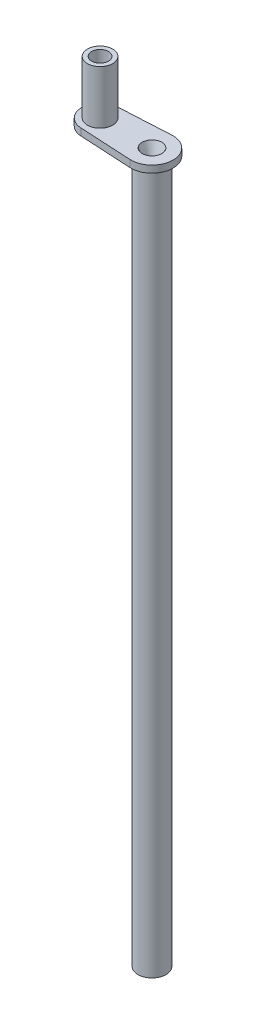
ISO-10303-21;
HEADER;
FILE_DESCRIPTION(('STEP AP214'),'2;1');
FILE_NAME('part.step','',(''),(''),'','','');
FILE_SCHEMA(('AUTOMOTIVE_DESIGN { 1 0 10303 214 1 1 1 1 }'));
ENDSEC;
DATA;
#1=APPLICATION_CONTEXT('core data for automotive mechanical design processes');
#2=APPLICATION_PROTOCOL_DEFINITION('international standard','automotive_design',2000,#1);
#3=PRODUCT_CONTEXT('',#1,'mechanical');
#4=PRODUCT('Part','Part','',(#3));
#5=PRODUCT_RELATED_PRODUCT_CATEGORY('part','',(#4));
#6=PRODUCT_DEFINITION_FORMATION('','',#4);
#7=PRODUCT_DEFINITION_CONTEXT('part definition',#1,'design');
#8=PRODUCT_DEFINITION('design','',#6,#7);
#9=PRODUCT_DEFINITION_SHAPE('','',#8);
#10=(LENGTH_UNIT() NAMED_UNIT(*) SI_UNIT(.MILLI.,.METRE.));
#11=(NAMED_UNIT(*) PLANE_ANGLE_UNIT() SI_UNIT($,.RADIAN.));
#12=(NAMED_UNIT(*) SI_UNIT($,.STERADIAN.) SOLID_ANGLE_UNIT());
#13=UNCERTAINTY_MEASURE_WITH_UNIT(LENGTH_MEASURE(1.E-05),#10,'distance_accuracy_value','');
#14=(GEOMETRIC_REPRESENTATION_CONTEXT(3) GLOBAL_UNCERTAINTY_ASSIGNED_CONTEXT((#13)) GLOBAL_UNIT_ASSIGNED_CONTEXT((#10,
#11,#12)) REPRESENTATION_CONTEXT('',''));
#15=CARTESIAN_POINT('',(0.,0.,0.));
#16=DIRECTION('',(0.,0.,1.));
#17=DIRECTION('',(1.,0.,0.));
#18=AXIS2_PLACEMENT_3D('',#15,#16,#17);
#19=CARTESIAN_POINT('',(-11.9752615473774,250.,-2.21460316287116));
#20=DIRECTION('',(0.,-1.,0.));
#21=DIRECTION('',(0.,0.,-1.));
#22=AXIS2_PLACEMENT_3D('',#19,#20,#21);
#23=CYLINDRICAL_SURFACE('',#22,5.);
#24=CARTESIAN_POINT('',(-11.9752615473774,250.,-2.21460316287116));
#25=DIRECTION('',(0.,1.,0.));
#26=DIRECTION('',(0.,0.,1.));
#27=AXIS2_PLACEMENT_3D('',#24,#25,#26);
#28=CIRCLE('',#27,5.);
#29=CARTESIAN_POINT('',(-11.9752615473774,250.,2.78539683712884));
#30=VERTEX_POINT('',#29);
#31=EDGE_CURVE('E12',#30,#30,#28,.T.);
#32=ORIENTED_EDGE('',*,*,#31,.F.);
#33=EDGE_LOOP('',(#32));
#34=FACE_BOUND('',#33,.T.);
#35=CARTESIAN_POINT('',(-11.9752615473774,0.,-2.21460316287116));
#36=DIRECTION('',(0.,1.,0.));
#37=DIRECTION('',(0.,0.,1.));
#38=AXIS2_PLACEMENT_3D('',#35,#36,#37);
#39=CIRCLE('',#38,5.);
#40=CARTESIAN_POINT('',(-11.9752615473774,0.,2.78539683712884));
#41=VERTEX_POINT('',#40);
#42=EDGE_CURVE('E47',#41,#41,#39,.T.);
#43=ORIENTED_EDGE('',*,*,#42,.T.);
#44=EDGE_LOOP('',(#43));
#45=FACE_BOUND('',#44,.T.);
#46=ADVANCED_FACE('F37',(#34,#45),#23,.T.);
#47=CARTESIAN_POINT('',(-11.9752615473774,0.,-2.21460316287116));
#48=DIRECTION('',(0.,1.,0.));
#49=DIRECTION('',(0.,0.,1.));
#50=AXIS2_PLACEMENT_3D('',#47,#48,#49);
#51=PLANE('',#50);
#52=CARTESIAN_POINT('',(-11.9752615473774,0.,-2.21460316287116));
#53=DIRECTION('',(0.,-1.,0.));
#54=DIRECTION('',(0.,0.,-1.));
#55=AXIS2_PLACEMENT_3D('',#52,#53,#54);
#56=CIRCLE('',#55,4.);
#57=CARTESIAN_POINT('',(-14.3869797141335,0.,0.976574595283127));
#58=VERTEX_POINT('',#57);
#59=EDGE_CURVE('E170',#58,#58,#56,.T.);
#60=ORIENTED_EDGE('',*,*,#59,.F.);
#61=EDGE_LOOP('',(#60));
#62=FACE_BOUND('',#61,.T.);
#63=ORIENTED_EDGE('',*,*,#42,.F.);
#64=EDGE_LOOP('',(#63));
#65=FACE_BOUND('',#64,.T.);
#66=ADVANCED_FACE('F143',(#62,#65),#51,.F.);
#67=CARTESIAN_POINT('',(-11.9752615473774,7.,-2.21460316287116));
#68=DIRECTION('',(0.,-1.,0.));
#69=DIRECTION('',(0.,0.,-1.));
#70=AXIS2_PLACEMENT_3D('',#67,#68,#69);
#71=PLANE('',#70);
#72=CARTESIAN_POINT('',(-11.9752615473774,7.,-2.21460316287116));
#73=DIRECTION('',(0.,-1.,0.));
#74=DIRECTION('',(0.,0.,-1.));
#75=AXIS2_PLACEMENT_3D('',#72,#73,#74);
#76=CIRCLE('',#75,1.);
#77=CARTESIAN_POINT('',(-12.7560846521862,7.,-1.589850988808));
#78=VERTEX_POINT('',#77);
#79=EDGE_CURVE('E117',#78,#78,#76,.T.);
#80=ORIENTED_EDGE('',*,*,#79,.T.);
#81=EDGE_LOOP('',(#80));
#82=FACE_BOUND('',#81,.T.);
#83=ADVANCED_FACE('F140',(#82),#71,.T.);
#84=CARTESIAN_POINT('',(-12.7560846521862,7.,-1.589850988808));
#85=CARTESIAN_POINT('',(-14.3869797141335,0.,0.976574595283127));
#86=CARTESIAN_POINT('',(-14.0055890003126,7.,-3.15149719842574));
#87=CARTESIAN_POINT('',(-20.769335230442,0.,-3.84686173822906));
#88=CARTESIAN_POINT('',(-12.4439427906948,7.,-4.40100154655205));
#89=CARTESIAN_POINT('',(-15.9458988969298,0.,-10.2292172545376));
#90=CARTESIAN_POINT('',(-11.1944384425685,7.,-2.83935533693431));
#91=CARTESIAN_POINT('',(-9.56354338062128,0.,-5.40578092102544));
#92=CARTESIAN_POINT('',(-9.9449340944422,7.,-1.27770912731657));
#93=CARTESIAN_POINT('',(-3.18118786431272,0.,-0.582344587513256));
#94=CARTESIAN_POINT('',(-11.5065803040599,7.,-0.028204779190265));
#95=CARTESIAN_POINT('',(-8.0046241978249,0.,5.80001092879531));
#96=CARTESIAN_POINT('',(-12.7560846521862,7.,-1.589850988808));
#97=CARTESIAN_POINT('',(-14.3869797141335,0.,0.976574595283127));
#98=(BOUNDED_SURFACE() B_SPLINE_SURFACE(3,1,((#84,#85),(#86,#87),(#88,#89),(#90,#91),(#92,#93),
(#94,#95),(#96,#97)),.UNSPECIFIED.,.T.,.F.,.F.) B_SPLINE_SURFACE_WITH_KNOTS((4,3,4),(2,2),(0.,
0.5,1.),(0.,1.),.UNSPECIFIED.) GEOMETRIC_REPRESENTATION_ITEM() RATIONAL_B_SPLINE_SURFACE(((1.,
1.),(0.333333333333333,0.333333333333334),(0.333333333333333,0.333333333333334),(1.,1.),
(0.333333333333333,0.333333333333333),(0.333333333333333,0.333333333333333),(1.,1.))) REPRESENTATION_ITEM('') SURFACE());
#99=CARTESIAN_POINT('',(-12.7560846521862,7.,-1.589850988808));
#100=CARTESIAN_POINT('',(-12.7730731424149,6.92708333333333,-1.56311738897372));
#101=CARTESIAN_POINT('',(-12.7900616326435,6.85416666666667,-1.53638378913944));
#102=CARTESIAN_POINT('',(-12.8240386131007,6.70833333333333,-1.48291658947087));
#103=CARTESIAN_POINT('',(-12.8410271033293,6.63541666666667,-1.45618298963659));
#104=CARTESIAN_POINT('',(-12.8750040837866,6.48958333333333,-1.40271578996803));
#105=CARTESIAN_POINT('',(-12.8919925740152,6.41666666666667,-1.37598219013374));
#106=CARTESIAN_POINT('',(-12.9259695544724,6.27083333333333,-1.32251499046518));
#107=CARTESIAN_POINT('',(-12.942958044701,6.19791666666667,-1.2957813906309));
#108=CARTESIAN_POINT('',(-12.9769350251583,6.05208333333333,-1.24231419096233));
#109=CARTESIAN_POINT('',(-12.9939235153869,5.97916666666667,-1.21558059112805));
#110=CARTESIAN_POINT('',(-13.0279004958441,5.83333333333333,-1.16211339145948));
#111=CARTESIAN_POINT('',(-13.0448889860727,5.76041666666667,-1.1353797916252));
#112=CARTESIAN_POINT('',(-13.07886596653,5.61458333333333,-1.08191259195663));
#113=CARTESIAN_POINT('',(-13.0958544567586,5.54166666666667,-1.05517899212235));
#114=CARTESIAN_POINT('',(-13.1298314372158,5.39583333333333,-1.00171179245379));
#115=CARTESIAN_POINT('',(-13.1468199274444,5.32291666666667,-0.974978192619504));
#116=CARTESIAN_POINT('',(-13.1807969079017,5.17708333333333,-0.921510992950939));
#117=CARTESIAN_POINT('',(-13.1977853981303,5.10416666666667,-0.894777393116656));
#118=CARTESIAN_POINT('',(-13.2317623785875,4.95833333333333,-0.841310193448091));
#119=CARTESIAN_POINT('',(-13.2487508688161,4.88541666666667,-0.814576593613809));
#120=CARTESIAN_POINT('',(-13.2827278492734,4.73958333333333,-0.761109393945243));
#121=CARTESIAN_POINT('',(-13.299716339502,4.66666666666667,-0.734375794110961));
#122=CARTESIAN_POINT('',(-13.3336933199592,4.52083333333333,-0.680908594442395));
#123=CARTESIAN_POINT('',(-13.3506818101878,4.44791666666667,-0.654174994608113));
#124=CARTESIAN_POINT('',(-13.3846587906451,4.30208333333333,-0.600707794939548));
#125=CARTESIAN_POINT('',(-13.4016472808737,4.22916666666667,-0.573974195105265));
#126=CARTESIAN_POINT('',(-13.4356242613309,4.08333333333333,-0.5205069954367));
#127=CARTESIAN_POINT('',(-13.4526127515595,4.01041666666667,-0.493773395602417));
#128=CARTESIAN_POINT('',(-13.4865897320168,3.86458333333333,-0.440306195933852));
#129=CARTESIAN_POINT('',(-13.5035782222454,3.79166666666667,-0.413572596099569));
#130=CARTESIAN_POINT('',(-13.5375552027026,3.64583333333333,-0.360105396431004));
#131=CARTESIAN_POINT('',(-13.5545436929312,3.57291666666667,-0.333371796596721));
#132=CARTESIAN_POINT('',(-13.5885206733885,3.42708333333333,-0.279904596928156));
#133=CARTESIAN_POINT('',(-13.6055091636171,3.35416666666667,-0.253170997093874));
#134=CARTESIAN_POINT('',(-13.6394861440743,3.20833333333333,-0.199703797425308));
#135=CARTESIAN_POINT('',(-13.6564746343029,3.13541666666667,-0.172970197591026));
#136=CARTESIAN_POINT('',(-13.6904516147602,2.98958333333333,-0.11950299792246));
#137=CARTESIAN_POINT('',(-13.7074401049888,2.91666666666667,-0.0927693980881779));
#138=CARTESIAN_POINT('',(-13.741417085446,2.77083333333333,-0.0393021984196126));
#139=CARTESIAN_POINT('',(-13.7584055756746,2.69791666666667,-0.0125685985853299));
#140=CARTESIAN_POINT('',(-13.7923825561319,2.55208333333333,0.0408986010832353));
#141=CARTESIAN_POINT('',(-13.8093710463605,2.47916666666667,0.0676322009175178));
#142=CARTESIAN_POINT('',(-13.8433480268177,2.33333333333333,0.121099400586083));
#143=CARTESIAN_POINT('',(-13.8603365170463,2.26041666666667,0.147833000420366));
#144=CARTESIAN_POINT('',(-13.8943134975036,2.11458333333333,0.201300200088931));
#145=CARTESIAN_POINT('',(-13.9113019877322,2.04166666666667,0.228033799923214));
#146=CARTESIAN_POINT('',(-13.9452789681894,1.89583333333333,0.281500999591779));
#147=CARTESIAN_POINT('',(-13.9622674584181,1.82291666666667,0.308234599426061));
#148=CARTESIAN_POINT('',(-13.9962444388753,1.67708333333333,0.361701799094627));
#149=CARTESIAN_POINT('',(-14.0132329291039,1.60416666666667,0.388435398928909));
#150=CARTESIAN_POINT('',(-14.0472099095611,1.45833333333333,0.441902598597474));
#151=CARTESIAN_POINT('',(-14.0641983997898,1.38541666666667,0.468636198431757));
#152=CARTESIAN_POINT('',(-14.098175380247,1.23958333333333,0.522103398100322));
#153=CARTESIAN_POINT('',(-14.1151638704756,1.16666666666667,0.548836997934605));
#154=CARTESIAN_POINT('',(-14.1491408509328,1.02083333333333,0.60230419760317));
#155=CARTESIAN_POINT('',(-14.1661293411615,0.947916666666667,0.629037797437453));
#156=CARTESIAN_POINT('',(-14.2001063216187,0.802083333333333,0.682504997106018));
#157=CARTESIAN_POINT('',(-14.2170948118473,0.729166666666667,0.709238596940301));
#158=CARTESIAN_POINT('',(-14.2510717923045,0.583333333333333,0.762705796608866));
#159=CARTESIAN_POINT('',(-14.2680602825332,0.510416666666667,0.789439396443148));
#160=CARTESIAN_POINT('',(-14.3020372629904,0.364583333333333,0.842906596111714));
#161=CARTESIAN_POINT('',(-14.319025753219,0.291666666666667,0.869640195945996));
#162=CARTESIAN_POINT('',(-14.3530027336762,0.145833333333333,0.923107395614561));
#163=CARTESIAN_POINT('',(-14.3699912239049,0.0729166666666665,0.949840995448844));
#164=CARTESIAN_POINT('',(-14.3869797141335,0.,0.976574595283127));
#165=B_SPLINE_CURVE_WITH_KNOTS('',3,(#99,#100,#101,#102,#103,#104,#105,#106,#107,#108,#109,#110,
#111,#112,#113,#114,#115,#116,#117,#118,#119,#120,#121,#122,#123,#124,#125,#126,#127,#128,#129,
#130,#131,#132,#133,#134,#135,#136,#137,#138,#139,#140,#141,#142,#143,#144,#145,#146,#147,#148,
#149,#150,#151,#152,#153,#154,#155,#156,#157,#158,#159,#160,#161,#162,#163,#164),.UNSPECIFIED.,
.F.,.F.,(4,2,2,2,2,2,2,2,2,2,2,2,2,2,2,2,2,2,2,2,2,2,2,2,2,2,2,2,2,2,2,2,4),(0.,0.2384978195773,
0.4769956391546,0.7154934587319,0.953991278309199,1.1924890978865,1.4309869174638,
1.6694847370411,1.9079825566184,2.1464803761957,2.384978195773,2.6234760153503,2.8619738349276,
3.1004716545049,3.3389694740822,3.5774672936595,3.8159651132368,4.0544629328141,4.2929607523914,
4.5314585719687,4.769956391546,5.0084542111233,5.2469520307006,5.4854498502779,5.7239476698552,
5.9624454894325,6.2009433090098,6.4394411285871,6.6779389481644,6.9164367677417,7.154934587319,
7.3934324068963,7.6319302264736),.UNSPECIFIED.);
#166=EDGE_CURVE('BSEAM128',#78,#58,#165,.T.);
#167=ORIENTED_EDGE('',*,*,#79,.F.);
#168=ORIENTED_EDGE('',*,*,#59,.T.);
#169=ORIENTED_EDGE('',*,*,#166,.T.);
#170=ORIENTED_EDGE('',*,*,#166,.F.);
#171=EDGE_LOOP('',(#167,#169,#168,#170));
#172=FACE_BOUND('',#171,.T.);
#173=ADVANCED_FACE('F128',(#172),#98,.F.);
#174=CARTESIAN_POINT('',(-30.4752615473774,252.5,-2.21460316287116));
#175=DIRECTION('',(0.,-1.,0.));
#176=DIRECTION('',(0.,0.,-1.));
#177=AXIS2_PLACEMENT_3D('',#174,#175,#176);
#178=CYLINDRICAL_SURFACE('',#177,6.5);
#179=CARTESIAN_POINT('',(-30.4752615473774,250.,-2.21460316287116));
#180=DIRECTION('',(0.,1.,0.));
#181=DIRECTION('',(0.,0.,1.));
#182=AXIS2_PLACEMENT_3D('',#179,#180,#181);
#183=CIRCLE('',#182,6.5);
#184=CARTESIAN_POINT('',(-30.8266128987287,250.,-8.70510023381292));
#185=VERTEX_POINT('',#184);
#186=CARTESIAN_POINT('',(-30.8266128987287,250.,4.27589390807061));
#187=VERTEX_POINT('',#186);
#188=EDGE_CURVE('E107',#185,#187,#183,.T.);
#189=ORIENTED_EDGE('',*,*,#188,.T.);
#190=DIRECTION('',(0.,-1.,0.));
#191=VECTOR('',#190,1.);
#192=CARTESIAN_POINT('',(-30.8266128987287,252.5,4.27589390807061));
#193=LINE('',#192,#191);
#194=CARTESIAN_POINT('',(-30.8266128987287,252.5,4.27589390807061));
#195=VERTEX_POINT('',#194);
#196=EDGE_CURVE('E98',#195,#187,#193,.T.);
#197=ORIENTED_EDGE('',*,*,#196,.F.);
#198=CARTESIAN_POINT('',(-30.4752615473774,252.5,-2.21460316287116));
#199=DIRECTION('',(0.,1.,0.));
#200=DIRECTION('',(0.,0.,1.));
#201=AXIS2_PLACEMENT_3D('',#198,#199,#200);
#202=CIRCLE('',#201,6.5);
#203=CARTESIAN_POINT('',(-30.8266128987287,252.5,-8.70510023381292));
#204=VERTEX_POINT('',#203);
#205=EDGE_CURVE('E92',#204,#195,#202,.T.);
#206=ORIENTED_EDGE('',*,*,#205,.F.);
#207=DIRECTION('',(0.,-1.,0.));
#208=VECTOR('',#207,1.);
#209=CARTESIAN_POINT('',(-30.8266128987287,252.5,-8.70510023381292));
#210=LINE('',#209,#208);
#211=EDGE_CURVE('E103',#204,#185,#210,.T.);
#212=ORIENTED_EDGE('',*,*,#211,.T.);
#213=EDGE_LOOP('',(#189,#197,#206,#212));
#214=FACE_BOUND('',#213,.T.);
#215=ADVANCED_FACE('F139',(#214),#178,.T.);
#216=CARTESIAN_POINT('',(-30.8266128987287,252.5,4.27589390807061));
#217=DIRECTION('',(0.054054054054054,0.,-0.998538010914117));
#218=DIRECTION('',(-0.998538010914117,0.,-0.054054054054054));
#219=AXIS2_PLACEMENT_3D('',#216,#217,#218);
#220=PLANE('',#219);
#221=DIRECTION('',(0.998538010914117,0.,0.054054054054054));
#222=VECTOR('',#221,1.);
#223=CARTESIAN_POINT('',(-30.8266128987287,250.,4.27589390807061));
#224=LINE('',#223,#222);
#225=CARTESIAN_POINT('',(-12.3806669527828,250.,5.27443191898472));
#226=VERTEX_POINT('',#225);
#227=EDGE_CURVE('E97',#187,#226,#224,.T.);
#228=ORIENTED_EDGE('',*,*,#227,.T.);
#229=DIRECTION('',(0.,-1.,0.));
#230=VECTOR('',#229,1.);
#231=CARTESIAN_POINT('',(-12.3806669527828,252.5,5.27443191898472));
#232=LINE('',#231,#230);
#233=CARTESIAN_POINT('',(-12.3806669527828,252.5,5.27443191898472));
#234=VERTEX_POINT('',#233);
#235=EDGE_CURVE('E95',#234,#226,#232,.T.);
#236=ORIENTED_EDGE('',*,*,#235,.F.);
#237=DIRECTION('',(0.998538010914117,0.,0.054054054054054));
#238=VECTOR('',#237,1.);
#239=CARTESIAN_POINT('',(-30.8266128987287,252.5,4.27589390807061));
#240=LINE('',#239,#238);
#241=EDGE_CURVE('E87',#195,#234,#240,.T.);
#242=ORIENTED_EDGE('',*,*,#241,.F.);
#243=ORIENTED_EDGE('',*,*,#196,.T.);
#244=EDGE_LOOP('',(#228,#236,#242,#243));
#245=FACE_BOUND('',#244,.T.);
#246=ADVANCED_FACE('F96',(#245),#220,.F.);
#247=CARTESIAN_POINT('',(-11.9752615473774,252.5,-2.21460316287116));
#248=DIRECTION('',(0.,-1.,0.));
#249=DIRECTION('',(0.,0.,-1.));
#250=AXIS2_PLACEMENT_3D('',#247,#248,#249);
#251=CYLINDRICAL_SURFACE('',#250,7.5);
#252=CARTESIAN_POINT('',(-11.9752615473774,250.,-2.21460316287116));
#253=DIRECTION('',(0.,1.,0.));
#254=DIRECTION('',(0.,0.,1.));
#255=AXIS2_PLACEMENT_3D('',#252,#253,#254);
#256=CIRCLE('',#255,7.5);
#257=CARTESIAN_POINT('',(-12.3806669527828,250.,-9.70363824472704));
#258=VERTEX_POINT('',#257);
#259=EDGE_CURVE('E73',#226,#258,#256,.T.);
#260=ORIENTED_EDGE('',*,*,#259,.T.);
#261=DIRECTION('',(0.,-1.,0.));
#262=VECTOR('',#261,1.);
#263=CARTESIAN_POINT('',(-12.3806669527828,252.5,-9.70363824472704));
#264=LINE('',#263,#262);
#265=CARTESIAN_POINT('',(-12.3806669527828,252.5,-9.70363824472704));
#266=VERTEX_POINT('',#265);
#267=EDGE_CURVE('E99',#266,#258,#264,.T.);
#268=ORIENTED_EDGE('',*,*,#267,.F.);
#269=CARTESIAN_POINT('',(-11.9752615473774,252.5,-2.21460316287116));
#270=DIRECTION('',(0.,1.,0.));
#271=DIRECTION('',(0.,0.,1.));
#272=AXIS2_PLACEMENT_3D('',#269,#270,#271);
#273=CIRCLE('',#272,7.5);
#274=EDGE_CURVE('E90',#234,#266,#273,.T.);
#275=ORIENTED_EDGE('',*,*,#274,.F.);
#276=ORIENTED_EDGE('',*,*,#235,.T.);
#277=EDGE_LOOP('',(#260,#268,#275,#276));
#278=FACE_BOUND('',#277,.T.);
#279=ADVANCED_FACE('F101',(#278),#251,.T.);
#280=CARTESIAN_POINT('',(-30.8266128987287,252.5,-8.70510023381292));
#281=DIRECTION('',(0.0540540540540542,0.,0.998538010914117));
#282=DIRECTION('',(0.998538010914117,0.,-0.0540540540540542));
#283=AXIS2_PLACEMENT_3D('',#280,#281,#282);
#284=PLANE('',#283);
#285=DIRECTION('',(-0.998538010914117,0.,0.0540540540540542));
#286=VECTOR('',#285,1.);
#287=CARTESIAN_POINT('',(-30.8266128987287,250.,-8.70510023381292));
#288=LINE('',#287,#286);
#289=EDGE_CURVE('E79',#258,#185,#288,.T.);
#290=ORIENTED_EDGE('',*,*,#289,.T.);
#291=ORIENTED_EDGE('',*,*,#211,.F.);
#292=DIRECTION('',(-0.998538010914117,0.,0.0540540540540542));
#293=VECTOR('',#292,1.);
#294=CARTESIAN_POINT('',(-30.8266128987287,252.5,-8.70510023381292));
#295=LINE('',#294,#293);
#296=EDGE_CURVE('E56',#266,#204,#295,.T.);
#297=ORIENTED_EDGE('',*,*,#296,.F.);
#298=ORIENTED_EDGE('',*,*,#267,.T.);
#299=EDGE_LOOP('',(#290,#291,#297,#298));
#300=FACE_BOUND('',#299,.T.);
#301=ADVANCED_FACE('F198',(#300),#284,.F.);
#302=CARTESIAN_POINT('',(-30.4752615473774,252.5,-2.21460316287116));
#303=DIRECTION('',(0.,1.,0.));
#304=DIRECTION('',(0.,0.,1.));
#305=AXIS2_PLACEMENT_3D('',#302,#303,#304);
#306=PLANE('',#305);
#307=CARTESIAN_POINT('',(-30.4752615473774,252.5,-2.21460316287116));
#308=DIRECTION('',(0.,1.,0.));
#309=DIRECTION('',(0.,0.,1.));
#310=AXIS2_PLACEMENT_3D('',#307,#308,#309);
#311=CIRCLE('',#310,4.5);
#312=CARTESIAN_POINT('',(-30.4752615473774,252.5,2.28539683712885));
#313=VERTEX_POINT('',#312);
#314=EDGE_CURVE('E322',#313,#313,#311,.T.);
#315=ORIENTED_EDGE('',*,*,#314,.F.);
#316=EDGE_LOOP('',(#315));
#317=FACE_BOUND('',#316,.T.);
#318=CARTESIAN_POINT('',(-11.9752615473774,252.5,-2.21460316287116));
#319=DIRECTION('',(0.,1.,0.));
#320=DIRECTION('',(0.,0.,1.));
#321=AXIS2_PLACEMENT_3D('',#318,#319,#320);
#322=CIRCLE('',#321,3.5);
#323=CARTESIAN_POINT('',(-14.6295282508879,252.5,0.0668148756819186));
#324=VERTEX_POINT('',#323);
#325=EDGE_CURVE('E110',#324,#324,#322,.T.);
#326=ORIENTED_EDGE('',*,*,#325,.F.);
#327=EDGE_LOOP('',(#326));
#328=FACE_BOUND('',#327,.T.);
#329=ORIENTED_EDGE('',*,*,#205,.T.);
#330=ORIENTED_EDGE('',*,*,#241,.T.);
#331=ORIENTED_EDGE('',*,*,#274,.T.);
#332=ORIENTED_EDGE('',*,*,#296,.T.);
#333=EDGE_LOOP('',(#329,#330,#331,#332));
#334=FACE_BOUND('',#333,.T.);
#335=ADVANCED_FACE('F88',(#317,#328,#334),#306,.T.);
#336=CARTESIAN_POINT('',(-30.4752615473774,250.,-2.21460316287116));
#337=DIRECTION('',(0.,1.,0.));
#338=DIRECTION('',(0.,0.,1.));
#339=AXIS2_PLACEMENT_3D('',#336,#337,#338);
#340=PLANE('',#339);
#341=CARTESIAN_POINT('',(-30.4752615473774,250.,-2.21460316287116));
#342=DIRECTION('',(0.,1.,0.));
#343=DIRECTION('',(0.,0.,1.));
#344=AXIS2_PLACEMENT_3D('',#341,#342,#343);
#345=CIRCLE('',#344,3.);
#346=CARTESIAN_POINT('',(-30.4752615473774,250.,0.785396837128846));
#347=VERTEX_POINT('',#346);
#348=EDGE_CURVE('E327',#347,#347,#345,.F.);
#349=ORIENTED_EDGE('',*,*,#348,.F.);
#350=EDGE_LOOP('',(#349));
#351=FACE_BOUND('',#350,.T.);
#352=ORIENTED_EDGE('',*,*,#31,.T.);
#353=EDGE_LOOP('',(#352));
#354=FACE_BOUND('',#353,.T.);
#355=ORIENTED_EDGE('',*,*,#188,.F.);
#356=ORIENTED_EDGE('',*,*,#289,.F.);
#357=ORIENTED_EDGE('',*,*,#259,.F.);
#358=ORIENTED_EDGE('',*,*,#227,.F.);
#359=EDGE_LOOP('',(#355,#356,#357,#358));
#360=FACE_BOUND('',#359,.T.);
#361=ADVANCED_FACE('F190',(#351,#354,#360),#340,.F.);
#362=CARTESIAN_POINT('',(-11.9752615473774,244.5,-2.21460316287116));
#363=DIRECTION('',(0.,1.,0.));
#364=DIRECTION('',(0.,0.,1.));
#365=AXIS2_PLACEMENT_3D('',#362,#363,#364);
#366=PLANE('',#365);
#367=CARTESIAN_POINT('',(-11.9752615473774,244.5,-2.21460316287116));
#368=DIRECTION('',(0.,1.,0.));
#369=DIRECTION('',(0.,0.,1.));
#370=AXIS2_PLACEMENT_3D('',#367,#368,#369);
#371=CIRCLE('',#370,1.);
#372=CARTESIAN_POINT('',(-12.8787465118104,244.5,-2.64322294664629));
#373=VERTEX_POINT('',#372);
#374=EDGE_CURVE('E306',#373,#373,#371,.T.);
#375=ORIENTED_EDGE('',*,*,#374,.T.);
#376=EDGE_LOOP('',(#375));
#377=FACE_BOUND('',#376,.T.);
#378=ADVANCED_FACE('F193',(#377),#366,.T.);
#379=CARTESIAN_POINT('',(-12.8787465118104,244.5,-2.64322294664629));
#380=CARTESIAN_POINT('',(-14.6295282508879,252.5,0.0668148756819186));
#381=CARTESIAN_POINT('',(-13.7359860793607,244.5,-0.836253017780219));
#382=CARTESIAN_POINT('',(-10.0666921737818,252.5,5.37534828270297));
#383=CARTESIAN_POINT('',(-11.9290161504946,244.5,0.0209865497700398));
#384=CARTESIAN_POINT('',(-4.7581587667607,252.5,0.812512205596817));
#385=CARTESIAN_POINT('',(-11.0717765829443,244.5,-1.78598337909603));
#386=CARTESIAN_POINT('',(-9.32099484386685,252.5,-4.49602120142423));
#387=CARTESIAN_POINT('',(-10.2145370153941,244.5,-3.5929533079621));
#388=CARTESIAN_POINT('',(-13.883830920973,252.5,-9.80455460844528));
#389=CARTESIAN_POINT('',(-12.0215069442602,244.5,-4.45019287551235));
#390=CARTESIAN_POINT('',(-19.1923643279941,252.5,-5.24171853133913));
#391=CARTESIAN_POINT('',(-12.8787465118104,244.5,-2.64322294664629));
#392=CARTESIAN_POINT('',(-14.6295282508879,252.5,0.0668148756819186));
#393=(BOUNDED_SURFACE() B_SPLINE_SURFACE(3,1,((#379,#380),(#381,#382),(#383,#384),(#385,#386),
(#387,#388),(#389,#390),(#391,#392)),.UNSPECIFIED.,.T.,.F.,.F.) B_SPLINE_SURFACE_WITH_KNOTS((4,
3,4),(2,2),(0.,0.5,1.),(0.,1.),
.UNSPECIFIED.) GEOMETRIC_REPRESENTATION_ITEM() RATIONAL_B_SPLINE_SURFACE(((1.,1.),
(0.333333333333333,0.333333333333333),(0.333333333333333,0.333333333333333),(1.,1.),
(0.333333333333333,0.333333333333333),(0.333333333333333,0.333333333333333),(1.,1.))) REPRESENTATION_ITEM('') SURFACE());
#394=CARTESIAN_POINT('',(-12.8787465118104,244.5,-2.64322294664629));
#395=CARTESIAN_POINT('',(-12.8969838215925,244.583333333333,-2.61499338599703));
#396=CARTESIAN_POINT('',(-12.9152211313745,244.666666666667,-2.58676382534778));
#397=CARTESIAN_POINT('',(-12.9516957509386,244.833333333333,-2.53030470404928));
#398=CARTESIAN_POINT('',(-12.9699330607207,244.916666666667,-2.50207514340003));
#399=CARTESIAN_POINT('',(-13.0064076802848,245.083333333333,-2.44561602210152));
#400=CARTESIAN_POINT('',(-13.0246449900669,245.166666666667,-2.41738646145227));
#401=CARTESIAN_POINT('',(-13.061119609631,245.333333333333,-2.36092734015377));
#402=CARTESIAN_POINT('',(-13.079356919413,245.416666666667,-2.33269777950451));
#403=CARTESIAN_POINT('',(-13.1158315389772,245.583333333333,-2.27623865820601));
#404=CARTESIAN_POINT('',(-13.1340688487592,245.666666666667,-2.24800909755676));
#405=CARTESIAN_POINT('',(-13.1705434683233,245.833333333333,-2.19154997625825));
#406=CARTESIAN_POINT('',(-13.1887807781054,245.916666666667,-2.163320415609));
#407=CARTESIAN_POINT('',(-13.2252553976695,246.083333333333,-2.1068612943105));
#408=CARTESIAN_POINT('',(-13.2434927074516,246.166666666667,-2.07863173366124));
#409=CARTESIAN_POINT('',(-13.2799673270157,246.333333333333,-2.02217261236274));
#410=CARTESIAN_POINT('',(-13.2982046367977,246.416666666667,-1.99394305171349));
#411=CARTESIAN_POINT('',(-13.3346792563618,246.583333333333,-1.93748393041498));
#412=CARTESIAN_POINT('',(-13.3529165661439,246.666666666667,-1.90925436976573));
#413=CARTESIAN_POINT('',(-13.389391185708,246.833333333333,-1.85279524846723));
#414=CARTESIAN_POINT('',(-13.4076284954901,246.916666666667,-1.82456568781797));
#415=CARTESIAN_POINT('',(-13.4441031150542,247.083333333333,-1.76810656651947));
#416=CARTESIAN_POINT('',(-13.4623404248362,247.166666666667,-1.73987700587022));
#417=CARTESIAN_POINT('',(-13.4988150444004,247.333333333333,-1.68341788457171));
#418=CARTESIAN_POINT('',(-13.5170523541824,247.416666666667,-1.65518832392246));
#419=CARTESIAN_POINT('',(-13.5535269737465,247.583333333333,-1.59872920262396));
#420=CARTESIAN_POINT('',(-13.5717642835286,247.666666666667,-1.57049964197471));
#421=CARTESIAN_POINT('',(-13.6082389030927,247.833333333333,-1.5140405206762));
#422=CARTESIAN_POINT('',(-13.6264762128748,247.916666666667,-1.48581096002695));
#423=CARTESIAN_POINT('',(-13.6629508324389,248.083333333333,-1.42935183872844));
#424=CARTESIAN_POINT('',(-13.6811881422209,248.166666666667,-1.4011222780792));
#425=CARTESIAN_POINT('',(-13.717662761785,248.333333333333,-1.34466315678069));
#426=CARTESIAN_POINT('',(-13.7359000715671,248.416666666667,-1.31643359613143));
#427=CARTESIAN_POINT('',(-13.7723746911312,248.583333333333,-1.25997447483293));
#428=CARTESIAN_POINT('',(-13.7906120009133,248.666666666667,-1.23174491418368));
#429=CARTESIAN_POINT('',(-13.8270866204774,248.833333333333,-1.17528579288518));
#430=CARTESIAN_POINT('',(-13.8453239302594,248.916666666667,-1.14705623223592));
#431=CARTESIAN_POINT('',(-13.8817985498236,249.083333333333,-1.09059711093742));
#432=CARTESIAN_POINT('',(-13.9000358596056,249.166666666667,-1.06236755028817));
#433=CARTESIAN_POINT('',(-13.9365104791697,249.333333333333,-1.00590842898967));
#434=CARTESIAN_POINT('',(-13.9547477889518,249.416666666667,-0.97767886834041));
#435=CARTESIAN_POINT('',(-13.9912224085159,249.583333333333,-0.921219747041904));
#436=CARTESIAN_POINT('',(-14.009459718298,249.666666666667,-0.892990186392653));
#437=CARTESIAN_POINT('',(-14.0459343378621,249.833333333333,-0.836531065094151));
#438=CARTESIAN_POINT('',(-14.0641716476441,249.916666666667,-0.8083015044449));
#439=CARTESIAN_POINT('',(-14.1006462672082,250.083333333333,-0.751842383146394));
#440=CARTESIAN_POINT('',(-14.1188835769903,250.166666666667,-0.723612822497139));
#441=CARTESIAN_POINT('',(-14.1553581965544,250.333333333333,-0.667153701198634));
#442=CARTESIAN_POINT('',(-14.1735955063365,250.416666666667,-0.638924140549383));
#443=CARTESIAN_POINT('',(-14.2100701259006,250.583333333333,-0.582465019250882));
#444=CARTESIAN_POINT('',(-14.2283074356826,250.666666666667,-0.554235458601631));
#445=CARTESIAN_POINT('',(-14.2647820552468,250.833333333333,-0.497776337303127));
#446=CARTESIAN_POINT('',(-14.2830193650288,250.916666666667,-0.469546776653874));
#447=CARTESIAN_POINT('',(-14.3194939845929,251.083333333333,-0.413087655355366));
#448=CARTESIAN_POINT('',(-14.337731294375,251.166666666667,-0.384858094706112));
#449=CARTESIAN_POINT('',(-14.3742059139391,251.333333333333,-0.32839897340761));
#450=CARTESIAN_POINT('',(-14.3924432237212,251.416666666667,-0.300169412758362));
#451=CARTESIAN_POINT('',(-14.4289178432853,251.583333333333,-0.243710291459857));
#452=CARTESIAN_POINT('',(-14.4471551530673,251.666666666667,-0.2154807308106));
#453=CARTESIAN_POINT('',(-14.4836297726315,251.833333333333,-0.159021609512096));
#454=CARTESIAN_POINT('',(-14.5018670824135,251.916666666667,-0.130792048862848));
#455=CARTESIAN_POINT('',(-14.5383417019776,252.083333333333,-0.0743329275643456));
#456=CARTESIAN_POINT('',(-14.5565790117597,252.166666666667,-0.0461033669150904));
#457=CARTESIAN_POINT('',(-14.5930536313238,252.333333333333,0.0103557543834201));
#458=CARTESIAN_POINT('',(-14.6112909411059,252.416666666667,0.0385853150326754));
#459=CARTESIAN_POINT('',(-14.6295282508879,252.5,0.0668148756819186));
#460=B_SPLINE_CURVE_WITH_KNOTS('',3,(#394,#395,#396,#397,#398,#399,#400,#401,#402,#403,#404,
#405,#406,#407,#408,#409,#410,#411,#412,#413,#414,#415,#416,#417,#418,#419,#420,#421,#422,#423,
#424,#425,#426,#427,#428,#429,#430,#431,#432,#433,#434,#435,#436,#437,#438,#439,#440,#441,#442,
#443,#444,#445,#446,#447,#448,#449,#450,#451,#452,#453,#454,#455,#456,#457,#458,#459),
.UNSPECIFIED.,.F.,.F.,(4,2,2,2,2,2,2,2,2,2,2,2,2,2,2,2,2,2,2,2,2,2,2,2,2,2,2,2,2,2,2,2,4),(0.,
0.26956551719912,0.539131034398239,0.808696551597359,1.07826206879648,1.3478275859956,
1.61739310319472,1.88695862039384,2.15652413759296,2.42608965479208,2.6956551719912,
2.96522068919032,3.23478620638944,3.50435172358858,3.77391724078767,4.04348275798682,
4.31304827518591,4.58261379238506,4.85217930958415,5.1217448267833,5.39131034398239,
5.66087586118151,5.93044137838063,6.20000689557972,6.46957241277887,6.73913792997802,
7.00870344717711,7.2782689643762,7.54783448157535,7.81739999877444,8.08696551597359,
8.35653103317268,8.62609655037183),.UNSPECIFIED.);
#461=EDGE_CURVE('BSEAM238',#373,#324,#460,.T.);
#462=ORIENTED_EDGE('',*,*,#374,.F.);
#463=ORIENTED_EDGE('',*,*,#325,.T.);
#464=ORIENTED_EDGE('',*,*,#461,.T.);
#465=ORIENTED_EDGE('',*,*,#461,.F.);
#466=EDGE_LOOP('',(#462,#464,#463,#465));
#467=FACE_BOUND('',#466,.T.);
#468=ADVANCED_FACE('F238',(#467),#393,.F.);
#469=CARTESIAN_POINT('',(-30.4752615473774,271.5,-2.21460316287116));
#470=DIRECTION('',(0.,-1.,0.));
#471=DIRECTION('',(0.,0.,-1.));
#472=AXIS2_PLACEMENT_3D('',#469,#470,#471);
#473=CYLINDRICAL_SURFACE('',#472,4.5);
#474=CARTESIAN_POINT('',(-30.4752615473774,271.5,-2.21460316287116));
#475=DIRECTION('',(0.,1.,0.));
#476=DIRECTION('',(0.,0.,1.));
#477=AXIS2_PLACEMENT_3D('',#474,#475,#476);
#478=CIRCLE('',#477,4.5);
#479=CARTESIAN_POINT('',(-30.4752615473774,271.5,2.28539683712885));
#480=VERTEX_POINT('',#479);
#481=EDGE_CURVE('E313',#480,#480,#478,.T.);
#482=ORIENTED_EDGE('',*,*,#481,.F.);
#483=EDGE_LOOP('',(#482));
#484=FACE_BOUND('',#483,.T.);
#485=ORIENTED_EDGE('',*,*,#314,.T.);
#486=EDGE_LOOP('',(#485));
#487=FACE_BOUND('',#486,.T.);
#488=ADVANCED_FACE('F249',(#484,#487),#473,.T.);
#489=CARTESIAN_POINT('',(-30.4752615473774,271.5,-2.21460316287116));
#490=DIRECTION('',(0.,1.,0.));
#491=DIRECTION('',(0.,0.,1.));
#492=AXIS2_PLACEMENT_3D('',#489,#490,#491);
#493=PLANE('',#492);
#494=CARTESIAN_POINT('',(-30.4752615473774,271.5,-2.21460316287116));
#495=DIRECTION('',(0.,1.,0.));
#496=DIRECTION('',(0.,0.,1.));
#497=AXIS2_PLACEMENT_3D('',#494,#495,#496);
#498=CIRCLE('',#497,3.);
#499=CARTESIAN_POINT('',(-30.4752615473774,271.5,0.785396837128846));
#500=VERTEX_POINT('',#499);
#501=EDGE_CURVE('E340',#500,#500,#498,.T.);
#502=ORIENTED_EDGE('',*,*,#501,.F.);
#503=EDGE_LOOP('',(#502));
#504=FACE_BOUND('',#503,.T.);
#505=ORIENTED_EDGE('',*,*,#481,.T.);
#506=EDGE_LOOP('',(#505));
#507=FACE_BOUND('',#506,.T.);
#508=ADVANCED_FACE('F264',(#504,#507),#493,.T.);
#509=CARTESIAN_POINT('',(-30.4752615473774,-0.00109999999997612,-2.21460316287116));
#510=DIRECTION('',(0.,1.,0.));
#511=DIRECTION('',(0.,0.,1.));
#512=AXIS2_PLACEMENT_3D('',#509,#510,#511);
#513=CYLINDRICAL_SURFACE('',#512,3.);
#514=ORIENTED_EDGE('',*,*,#501,.T.);
#515=EDGE_LOOP('',(#514));
#516=FACE_BOUND('',#515,.T.);
#517=ORIENTED_EDGE('',*,*,#348,.T.);
#518=EDGE_LOOP('',(#517));
#519=FACE_BOUND('',#518,.T.);
#520=ADVANCED_FACE('F279',(#516,#519),#513,.F.);
#521=CLOSED_SHELL('',(#46,#66,#83,#173,#215,#246,#279,#301,#335,#361,#378,#468,#488,#508,#520));
#522=MANIFOLD_SOLID_BREP('B2',#521);
#523=ADVANCED_BREP_SHAPE_REPRESENTATION('',(#18,#522),#14);
#524=SHAPE_DEFINITION_REPRESENTATION(#9,#523);
ENDSEC;
END-ISO-10303-21;
